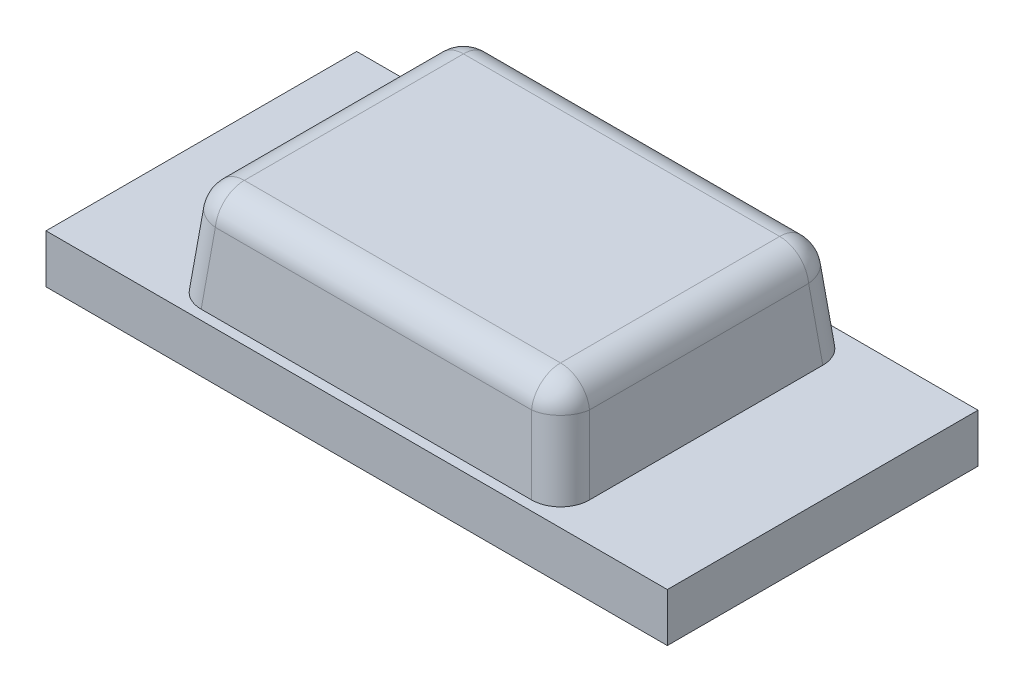
ISO-10303-21;
HEADER;
FILE_DESCRIPTION(('STEP AP214'),'2;1');
FILE_NAME('part.step','',(''),(''),'','','');
FILE_SCHEMA(('AUTOMOTIVE_DESIGN { 1 0 10303 214 1 1 1 1 }'));
ENDSEC;
DATA;
#1=APPLICATION_CONTEXT('core data for automotive mechanical design processes');
#2=APPLICATION_PROTOCOL_DEFINITION('international standard','automotive_design',2000,#1);
#3=PRODUCT_CONTEXT('',#1,'mechanical');
#4=PRODUCT('Part','Part','',(#3));
#5=PRODUCT_RELATED_PRODUCT_CATEGORY('part','',(#4));
#6=PRODUCT_DEFINITION_FORMATION('','',#4);
#7=PRODUCT_DEFINITION_CONTEXT('part definition',#1,'design');
#8=PRODUCT_DEFINITION('design','',#6,#7);
#9=PRODUCT_DEFINITION_SHAPE('','',#8);
#10=(LENGTH_UNIT() NAMED_UNIT(*) SI_UNIT(.MILLI.,.METRE.));
#11=(NAMED_UNIT(*) PLANE_ANGLE_UNIT() SI_UNIT($,.RADIAN.));
#12=(NAMED_UNIT(*) SI_UNIT($,.STERADIAN.) SOLID_ANGLE_UNIT());
#13=UNCERTAINTY_MEASURE_WITH_UNIT(LENGTH_MEASURE(1.E-05),#10,'distance_accuracy_value','');
#14=(GEOMETRIC_REPRESENTATION_CONTEXT(3) GLOBAL_UNCERTAINTY_ASSIGNED_CONTEXT((#13)) GLOBAL_UNIT_ASSIGNED_CONTEXT((#10,
#11,#12)) REPRESENTATION_CONTEXT('',''));
#15=CARTESIAN_POINT('',(0.,0.,0.));
#16=DIRECTION('',(0.,0.,1.));
#17=DIRECTION('',(1.,0.,0.));
#18=AXIS2_PLACEMENT_3D('',#15,#16,#17);
#19=CARTESIAN_POINT('',(0.,0.25,0.));
#20=DIRECTION('',(0.,-1.,0.));
#21=DIRECTION('',(0.,0.,-1.));
#22=AXIS2_PLACEMENT_3D('',#19,#20,#21);
#23=PLANE('',#22);
#24=DIRECTION('',(0.,0.,-1.));
#25=VECTOR('',#24,1.);
#26=CARTESIAN_POINT('',(1.6,0.25,0.799999999999998));
#27=LINE('',#26,#25);
#28=CARTESIAN_POINT('',(1.6,0.25,0.799999999999998));
#29=VERTEX_POINT('',#28);
#30=CARTESIAN_POINT('',(1.6,0.25,-0.800000000000002));
#31=VERTEX_POINT('',#30);
#32=EDGE_CURVE('E148',#29,#31,#27,.T.);
#33=ORIENTED_EDGE('',*,*,#32,.T.);
#34=DIRECTION('',(-1.,0.,0.));
#35=VECTOR('',#34,1.);
#36=CARTESIAN_POINT('',(-1.6,0.25,-0.800000000000002));
#37=LINE('',#36,#35);
#38=CARTESIAN_POINT('',(-1.6,0.25,-0.800000000000002));
#39=VERTEX_POINT('',#38);
#40=EDGE_CURVE('E137',#31,#39,#37,.T.);
#41=ORIENTED_EDGE('',*,*,#40,.T.);
#42=DIRECTION('',(0.,0.,1.));
#43=VECTOR('',#42,1.);
#44=CARTESIAN_POINT('',(-1.6,0.25,0.799999999999998));
#45=LINE('',#44,#43);
#46=CARTESIAN_POINT('',(-1.6,0.25,0.799999999999998));
#47=VERTEX_POINT('',#46);
#48=EDGE_CURVE('E147',#39,#47,#45,.T.);
#49=ORIENTED_EDGE('',*,*,#48,.T.);
#50=DIRECTION('',(1.,0.,0.));
#51=VECTOR('',#50,1.);
#52=CARTESIAN_POINT('',(-1.6,0.25,0.799999999999998));
#53=LINE('',#52,#51);
#54=EDGE_CURVE('E153',#47,#29,#53,.T.);
#55=ORIENTED_EDGE('',*,*,#54,.T.);
#56=EDGE_LOOP('',(#33,#41,#49,#55));
#57=FACE_BOUND('',#56,.T.);
#58=DIRECTION('',(0.,0.,-1.));
#59=VECTOR('',#58,1.);
#60=CARTESIAN_POINT('',(1.,0.25,0.750000000000002));
#61=LINE('',#60,#59);
#62=CARTESIAN_POINT('',(1.,0.25,0.600744266964108));
#63=VERTEX_POINT('',#62);
#64=CARTESIAN_POINT('',(1.,0.25,-0.600744266964107));
#65=VERTEX_POINT('',#64);
#66=EDGE_CURVE('E237',#63,#65,#61,.T.);
#67=ORIENTED_EDGE('',*,*,#66,.F.);
#68=CARTESIAN_POINT('',(0.849252021732466,0.25,0.599252021732468));
#69=DIRECTION('',(0.,-1.,0.));
#70=DIRECTION('',(0.707106781186548,0.,0.707106781186548));
#71=AXIS2_PLACEMENT_3D('',#68,#69,#70);
#72=ELLIPSE('',#71,0.151492263510379,0.15);
#73=CARTESIAN_POINT('',(0.850744266964105,0.25,0.750000000000002));
#74=VERTEX_POINT('',#73);
#75=EDGE_CURVE('E44',#63,#74,#72,.T.);
#76=ORIENTED_EDGE('',*,*,#75,.T.);
#77=DIRECTION('',(1.,0.,0.));
#78=VECTOR('',#77,1.);
#79=CARTESIAN_POINT('',(-1.,0.25,0.750000000000002));
#80=LINE('',#79,#78);
#81=CARTESIAN_POINT('',(-0.850744266964105,0.25,0.750000000000002));
#82=VERTEX_POINT('',#81);
#83=EDGE_CURVE('E248',#82,#74,#80,.T.);
#84=ORIENTED_EDGE('',*,*,#83,.F.);
#85=CARTESIAN_POINT('',(-0.849252021732466,0.25,0.599252021732468));
#86=DIRECTION('',(0.,-1.,0.));
#87=DIRECTION('',(-0.707106781186548,0.,0.707106781186548));
#88=AXIS2_PLACEMENT_3D('',#85,#86,#87);
#89=ELLIPSE('',#88,0.151492263510379,0.15);
#90=CARTESIAN_POINT('',(-1.,0.25,0.600744266964108));
#91=VERTEX_POINT('',#90);
#92=EDGE_CURVE('E11',#82,#91,#89,.T.);
#93=ORIENTED_EDGE('',*,*,#92,.T.);
#94=DIRECTION('',(0.,0.,1.));
#95=VECTOR('',#94,1.);
#96=CARTESIAN_POINT('',(-1.,0.25,0.750000000000002));
#97=LINE('',#96,#95);
#98=CARTESIAN_POINT('',(-1.,0.25,-0.600744266964107));
#99=VERTEX_POINT('',#98);
#100=EDGE_CURVE('E243',#99,#91,#97,.T.);
#101=ORIENTED_EDGE('',*,*,#100,.F.);
#102=CARTESIAN_POINT('',(-0.849252021732466,0.25,-0.599252021732468));
#103=DIRECTION('',(0.,-1.,0.));
#104=DIRECTION('',(-0.707106781186548,0.,-0.707106781186548));
#105=AXIS2_PLACEMENT_3D('',#102,#103,#104);
#106=ELLIPSE('',#105,0.151492263510379,0.15);
#107=CARTESIAN_POINT('',(-0.850744266964105,0.25,-0.750000000000002));
#108=VERTEX_POINT('',#107);
#109=EDGE_CURVE('E199',#99,#108,#106,.T.);
#110=ORIENTED_EDGE('',*,*,#109,.T.);
#111=DIRECTION('',(-1.,0.,0.));
#112=VECTOR('',#111,1.);
#113=CARTESIAN_POINT('',(-1.,0.25,-0.750000000000002));
#114=LINE('',#113,#112);
#115=CARTESIAN_POINT('',(0.850744266964105,0.25,-0.750000000000002));
#116=VERTEX_POINT('',#115);
#117=EDGE_CURVE('E239',#116,#108,#114,.T.);
#118=ORIENTED_EDGE('',*,*,#117,.F.);
#119=CARTESIAN_POINT('',(0.849252021732466,0.25,-0.599252021732468));
#120=DIRECTION('',(0.,-1.,0.));
#121=DIRECTION('',(0.707106781186548,0.,-0.707106781186548));
#122=AXIS2_PLACEMENT_3D('',#119,#120,#121);
#123=ELLIPSE('',#122,0.151492263510379,0.15);
#124=EDGE_CURVE('E201',#116,#65,#123,.T.);
#125=ORIENTED_EDGE('',*,*,#124,.T.);
#126=EDGE_LOOP('',(#67,#76,#84,#93,#101,#110,#118,#125));
#127=FACE_BOUND('',#126,.T.);
#128=ADVANCED_FACE('F35',(#57,#127),#23,.F.);
#129=CARTESIAN_POINT('',(1.6,0.25,0.799999999999998));
#130=DIRECTION('',(-1.,0.,0.));
#131=DIRECTION('',(0.,0.,1.));
#132=AXIS2_PLACEMENT_3D('',#129,#130,#131);
#133=PLANE('',#132);
#134=DIRECTION('',(0.,0.,-1.));
#135=VECTOR('',#134,1.);
#136=CARTESIAN_POINT('',(1.6,0.,0.799999999999998));
#137=LINE('',#136,#135);
#138=CARTESIAN_POINT('',(1.6,0.,0.799999999999998));
#139=VERTEX_POINT('',#138);
#140=CARTESIAN_POINT('',(1.6,0.,-0.800000000000002));
#141=VERTEX_POINT('',#140);
#142=EDGE_CURVE('E161',#139,#141,#137,.T.);
#143=ORIENTED_EDGE('',*,*,#142,.T.);
#144=DIRECTION('',(0.,-1.,0.));
#145=VECTOR('',#144,1.);
#146=CARTESIAN_POINT('',(1.6,0.25,-0.800000000000002));
#147=LINE('',#146,#145);
#148=EDGE_CURVE('E141',#31,#141,#147,.T.);
#149=ORIENTED_EDGE('',*,*,#148,.F.);
#150=ORIENTED_EDGE('',*,*,#32,.F.);
#151=DIRECTION('',(0.,-1.,0.));
#152=VECTOR('',#151,1.);
#153=CARTESIAN_POINT('',(1.6,0.25,0.799999999999998));
#154=LINE('',#153,#152);
#155=EDGE_CURVE('E253',#29,#139,#154,.T.);
#156=ORIENTED_EDGE('',*,*,#155,.T.);
#157=EDGE_LOOP('',(#143,#149,#150,#156));
#158=FACE_BOUND('',#157,.T.);
#159=ADVANCED_FACE('F159',(#158),#133,.F.);
#160=CARTESIAN_POINT('',(-1.6,0.25,-0.800000000000002));
#161=DIRECTION('',(0.,0.,1.));
#162=DIRECTION('',(1.,0.,0.));
#163=AXIS2_PLACEMENT_3D('',#160,#161,#162);
#164=PLANE('',#163);
#165=DIRECTION('',(-1.,0.,0.));
#166=VECTOR('',#165,1.);
#167=CARTESIAN_POINT('',(-1.6,0.,-0.800000000000002));
#168=LINE('',#167,#166);
#169=CARTESIAN_POINT('',(-1.6,0.,-0.800000000000002));
#170=VERTEX_POINT('',#169);
#171=EDGE_CURVE('E255',#141,#170,#168,.T.);
#172=ORIENTED_EDGE('',*,*,#171,.T.);
#173=DIRECTION('',(0.,-1.,0.));
#174=VECTOR('',#173,1.);
#175=CARTESIAN_POINT('',(-1.6,0.25,-0.800000000000002));
#176=LINE('',#175,#174);
#177=EDGE_CURVE('E144',#39,#170,#176,.T.);
#178=ORIENTED_EDGE('',*,*,#177,.F.);
#179=ORIENTED_EDGE('',*,*,#40,.F.);
#180=ORIENTED_EDGE('',*,*,#148,.T.);
#181=EDGE_LOOP('',(#172,#178,#179,#180));
#182=FACE_BOUND('',#181,.T.);
#183=ADVANCED_FACE('F139',(#182),#164,.F.);
#184=CARTESIAN_POINT('',(-1.6,0.25,0.799999999999998));
#185=DIRECTION('',(1.,0.,0.));
#186=DIRECTION('',(0.,0.,-1.));
#187=AXIS2_PLACEMENT_3D('',#184,#185,#186);
#188=PLANE('',#187);
#189=DIRECTION('',(0.,0.,1.));
#190=VECTOR('',#189,1.);
#191=CARTESIAN_POINT('',(-1.6,0.,0.799999999999998));
#192=LINE('',#191,#190);
#193=CARTESIAN_POINT('',(-1.6,0.,0.799999999999998));
#194=VERTEX_POINT('',#193);
#195=EDGE_CURVE('E257',#170,#194,#192,.T.);
#196=ORIENTED_EDGE('',*,*,#195,.T.);
#197=DIRECTION('',(0.,-1.,0.));
#198=VECTOR('',#197,1.);
#199=CARTESIAN_POINT('',(-1.6,0.25,0.799999999999998));
#200=LINE('',#199,#198);
#201=EDGE_CURVE('E166',#47,#194,#200,.T.);
#202=ORIENTED_EDGE('',*,*,#201,.F.);
#203=ORIENTED_EDGE('',*,*,#48,.F.);
#204=ORIENTED_EDGE('',*,*,#177,.T.);
#205=EDGE_LOOP('',(#196,#202,#203,#204));
#206=FACE_BOUND('',#205,.T.);
#207=ADVANCED_FACE('F269',(#206),#188,.F.);
#208=CARTESIAN_POINT('',(-1.6,0.25,0.799999999999998));
#209=DIRECTION('',(0.,0.,-1.));
#210=DIRECTION('',(-1.,0.,0.));
#211=AXIS2_PLACEMENT_3D('',#208,#209,#210);
#212=PLANE('',#211);
#213=DIRECTION('',(1.,0.,0.));
#214=VECTOR('',#213,1.);
#215=CARTESIAN_POINT('',(-1.6,0.,0.799999999999998));
#216=LINE('',#215,#214);
#217=EDGE_CURVE('E157',#194,#139,#216,.T.);
#218=ORIENTED_EDGE('',*,*,#217,.T.);
#219=ORIENTED_EDGE('',*,*,#155,.F.);
#220=ORIENTED_EDGE('',*,*,#54,.F.);
#221=ORIENTED_EDGE('',*,*,#201,.T.);
#222=EDGE_LOOP('',(#218,#219,#220,#221));
#223=FACE_BOUND('',#222,.T.);
#224=ADVANCED_FACE('F264',(#223),#212,.F.);
#225=CARTESIAN_POINT('',(0.,0.,0.));
#226=DIRECTION('',(0.,-1.,0.));
#227=DIRECTION('',(0.,0.,-1.));
#228=AXIS2_PLACEMENT_3D('',#225,#226,#227);
#229=PLANE('',#228);
#230=ORIENTED_EDGE('',*,*,#142,.F.);
#231=ORIENTED_EDGE('',*,*,#217,.F.);
#232=ORIENTED_EDGE('',*,*,#195,.F.);
#233=ORIENTED_EDGE('',*,*,#171,.F.);
#234=EDGE_LOOP('',(#230,#231,#232,#233));
#235=FACE_BOUND('',#234,.T.);
#236=ADVANCED_FACE('F268',(#235),#229,.T.);
#237=CARTESIAN_POINT('',(1.,0.25,0.750000000000002));
#238=DIRECTION('',(0.995038220239298,0.0994934181893926,0.));
#239=DIRECTION('',(-0.0994934181893926,0.995038220239299,0.));
#240=AXIS2_PLACEMENT_3D('',#237,#238,#239);
#241=PLANE('',#240);
#242=ORIENTED_EDGE('',*,*,#66,.T.);
#243=DIRECTION('',(-0.0990046045615373,0.990149572817778,0.0990046045615372));
#244=VECTOR('',#243,1.);
#245=CARTESIAN_POINT('',(0.986760123932997,0.382412605352665,-0.587504390897104));
#246=LINE('',#245,#244);
#247=CARTESIAN_POINT('',(0.96351141426808,0.614924012728409,-0.564255681232188));
#248=VERTEX_POINT('',#247);
#249=EDGE_CURVE('E52',#65,#248,#246,.T.);
#250=ORIENTED_EDGE('',*,*,#249,.T.);
#251=DIRECTION('',(0.,0.,-1.));
#252=VECTOR('',#251,1.);
#253=CARTESIAN_POINT('',(0.96351141426808,0.614924012728409,0.750000000000002));
#254=LINE('',#253,#252);
#255=CARTESIAN_POINT('',(0.96351141426808,0.614924012728409,0.564255681232188));
#256=VERTEX_POINT('',#255);
#257=EDGE_CURVE('E57',#248,#256,#254,.F.);
#258=ORIENTED_EDGE('',*,*,#257,.T.);
#259=DIRECTION('',(-0.0990046045615373,0.990149572817778,-0.0990046045615372));
#260=VECTOR('',#259,1.);
#261=CARTESIAN_POINT('',(1.00146299151958,0.235368554982266,0.602207258483684));
#262=LINE('',#261,#260);
#263=EDGE_CURVE('E195',#256,#63,#262,.F.);
#264=ORIENTED_EDGE('',*,*,#263,.T.);
#265=EDGE_LOOP('',(#242,#250,#258,#264));
#266=FACE_BOUND('',#265,.T.);
#267=ADVANCED_FACE('F289',(#266),#241,.T.);
#268=CARTESIAN_POINT('',(-1.,0.25,-0.750000000000002));
#269=DIRECTION('',(0.,0.0994934181893926,-0.995038220239298));
#270=DIRECTION('',(0.,0.995038220239299,0.0994934181893926));
#271=AXIS2_PLACEMENT_3D('',#268,#269,#270);
#272=PLANE('',#271);
#273=ORIENTED_EDGE('',*,*,#117,.T.);
#274=DIRECTION('',(0.0990046045615372,0.990149572817778,0.0990046045615372));
#275=VECTOR('',#274,1.);
#276=CARTESIAN_POINT('',(-0.852207258483682,0.235368554982266,-0.751462991519579));
#277=LINE('',#276,#275);
#278=CARTESIAN_POINT('',(-0.814255681232185,0.614924012728409,-0.713511414268082));
#279=VERTEX_POINT('',#278);
#280=EDGE_CURVE('E193',#108,#279,#277,.T.);
#281=ORIENTED_EDGE('',*,*,#280,.T.);
#282=DIRECTION('',(-1.,0.,0.));
#283=VECTOR('',#282,1.);
#284=CARTESIAN_POINT('',(-1.,0.614924012728409,-0.713511414268082));
#285=LINE('',#284,#283);
#286=CARTESIAN_POINT('',(0.814255681232186,0.614924012728409,-0.713511414268082));
#287=VERTEX_POINT('',#286);
#288=EDGE_CURVE('E191',#279,#287,#285,.F.);
#289=ORIENTED_EDGE('',*,*,#288,.T.);
#290=DIRECTION('',(-0.0990046045615372,0.990149572817778,0.0990046045615372));
#291=VECTOR('',#290,1.);
#292=CARTESIAN_POINT('',(0.832603435034909,0.431427288809464,-0.731859168070806));
#293=LINE('',#292,#291);
#294=EDGE_CURVE('E189',#287,#116,#293,.F.);
#295=ORIENTED_EDGE('',*,*,#294,.T.);
#296=EDGE_LOOP('',(#273,#281,#289,#295));
#297=FACE_BOUND('',#296,.T.);
#298=ADVANCED_FACE('F286',(#297),#272,.T.);
#299=CARTESIAN_POINT('',(-1.,0.25,0.750000000000002));
#300=DIRECTION('',(-0.995038220239298,0.0994934181893926,0.));
#301=DIRECTION('',(-0.0994934181893926,-0.995038220239299,0.));
#302=AXIS2_PLACEMENT_3D('',#299,#300,#301);
#303=PLANE('',#302);
#304=DIRECTION('',(0.,0.,1.));
#305=VECTOR('',#304,1.);
#306=CARTESIAN_POINT('',(-0.96351141426808,0.614924012728409,0.750000000000002));
#307=LINE('',#306,#305);
#308=CARTESIAN_POINT('',(-0.96351141426808,0.614924012728409,0.564255681232188));
#309=VERTEX_POINT('',#308);
#310=CARTESIAN_POINT('',(-0.96351141426808,0.614924012728409,-0.564255681232188));
#311=VERTEX_POINT('',#310);
#312=EDGE_CURVE('E185',#309,#311,#307,.F.);
#313=ORIENTED_EDGE('',*,*,#312,.T.);
#314=DIRECTION('',(0.0990046045615373,0.990149572817778,0.0990046045615372));
#315=VECTOR('',#314,1.);
#316=CARTESIAN_POINT('',(-0.986760123932997,0.382412605352665,-0.587504390897105));
#317=LINE('',#316,#315);
#318=EDGE_CURVE('E187',#311,#99,#317,.F.);
#319=ORIENTED_EDGE('',*,*,#318,.T.);
#320=ORIENTED_EDGE('',*,*,#100,.T.);
#321=DIRECTION('',(0.0990046045615373,0.990149572817778,-0.0990046045615372));
#322=VECTOR('',#321,1.);
#323=CARTESIAN_POINT('',(-1.00146299151958,0.235368554982266,0.602207258483684));
#324=LINE('',#323,#322);
#325=EDGE_CURVE('E183',#91,#309,#324,.T.);
#326=ORIENTED_EDGE('',*,*,#325,.T.);
#327=EDGE_LOOP('',(#313,#319,#320,#326));
#328=FACE_BOUND('',#327,.T.);
#329=ADVANCED_FACE('F297',(#328),#303,.T.);
#330=CARTESIAN_POINT('',(-1.,0.25,0.750000000000002));
#331=DIRECTION('',(0.,0.0994934181893926,0.995038220239298));
#332=DIRECTION('',(0.,-0.995038220239299,0.0994934181893926));
#333=AXIS2_PLACEMENT_3D('',#330,#331,#332);
#334=PLANE('',#333);
#335=ORIENTED_EDGE('',*,*,#83,.T.);
#336=DIRECTION('',(-0.0990046045615372,0.990149572817778,-0.0990046045615372));
#337=VECTOR('',#336,1.);
#338=CARTESIAN_POINT('',(0.832603435034909,0.431427288809464,0.731859168070806));
#339=LINE('',#338,#337);
#340=CARTESIAN_POINT('',(0.814255681232185,0.614924012728409,0.713511414268082));
#341=VERTEX_POINT('',#340);
#342=EDGE_CURVE('E181',#74,#341,#339,.T.);
#343=ORIENTED_EDGE('',*,*,#342,.T.);
#344=DIRECTION('',(1.,0.,0.));
#345=VECTOR('',#344,1.);
#346=CARTESIAN_POINT('',(-1.,0.614924012728409,0.713511414268082));
#347=LINE('',#346,#345);
#348=CARTESIAN_POINT('',(-0.814255681232185,0.614924012728409,0.713511414268082));
#349=VERTEX_POINT('',#348);
#350=EDGE_CURVE('E178',#341,#349,#347,.F.);
#351=ORIENTED_EDGE('',*,*,#350,.T.);
#352=DIRECTION('',(0.0990046045615372,0.990149572817778,-0.0990046045615372));
#353=VECTOR('',#352,1.);
#354=CARTESIAN_POINT('',(-0.852207258483682,0.235368554982266,0.751462991519579));
#355=LINE('',#354,#353);
#356=EDGE_CURVE('E176',#349,#82,#355,.F.);
#357=ORIENTED_EDGE('',*,*,#356,.T.);
#358=EDGE_LOOP('',(#335,#343,#351,#357));
#359=FACE_BOUND('',#358,.T.);
#360=ADVANCED_FACE('F302',(#359),#334,.T.);
#361=CARTESIAN_POINT('',(0.,0.75,0.));
#362=DIRECTION('',(0.,-1.,0.));
#363=DIRECTION('',(0.,0.,-1.));
#364=AXIS2_PLACEMENT_3D('',#361,#362,#363);
#365=PLANE('',#364);
#366=DIRECTION('',(0.,0.,-1.));
#367=VECTOR('',#366,1.);
#368=CARTESIAN_POINT('',(-0.814255681232185,0.75,0.));
#369=LINE('',#368,#367);
#370=CARTESIAN_POINT('',(-0.814255681232185,0.75,-0.564255681232187));
#371=VERTEX_POINT('',#370);
#372=CARTESIAN_POINT('',(-0.814255681232185,0.75,0.564255681232188));
#373=VERTEX_POINT('',#372);
#374=EDGE_CURVE('E171',#371,#373,#369,.F.);
#375=ORIENTED_EDGE('',*,*,#374,.T.);
#376=DIRECTION('',(-1.,0.,0.));
#377=VECTOR('',#376,1.);
#378=CARTESIAN_POINT('',(0.,0.75,0.564255681232188));
#379=LINE('',#378,#377);
#380=CARTESIAN_POINT('',(0.814255681232185,0.75,0.564255681232188));
#381=VERTEX_POINT('',#380);
#382=EDGE_CURVE('E173',#373,#381,#379,.F.);
#383=ORIENTED_EDGE('',*,*,#382,.T.);
#384=DIRECTION('',(0.,0.,1.));
#385=VECTOR('',#384,1.);
#386=CARTESIAN_POINT('',(0.814255681232185,0.75,0.));
#387=LINE('',#386,#385);
#388=CARTESIAN_POINT('',(0.814255681232185,0.75,-0.564255681232187));
#389=VERTEX_POINT('',#388);
#390=EDGE_CURVE('E162',#381,#389,#387,.F.);
#391=ORIENTED_EDGE('',*,*,#390,.T.);
#392=DIRECTION('',(1.,0.,0.));
#393=VECTOR('',#392,1.);
#394=CARTESIAN_POINT('',(0.,0.75,-0.564255681232187));
#395=LINE('',#394,#393);
#396=EDGE_CURVE('E164',#389,#371,#395,.F.);
#397=ORIENTED_EDGE('',*,*,#396,.T.);
#398=EDGE_LOOP('',(#375,#383,#391,#397));
#399=FACE_BOUND('',#398,.T.);
#400=ADVANCED_FACE('F301',(#399),#365,.F.);
#401=CARTESIAN_POINT('',(-0.837504390897102,0.367488592624256,-0.587504390897104));
#402=DIRECTION('',(-0.0990046045615372,-0.990149572817777,-0.0990046045615372));
#403=DIRECTION('',(0.,0.0994934181893926,-0.995038220239299));
#404=AXIS2_PLACEMENT_3D('',#401,#402,#403);
#405=CYLINDRICAL_SURFACE('',#404,0.15);
#406=ORIENTED_EDGE('',*,*,#109,.F.);
#407=ORIENTED_EDGE('',*,*,#318,.F.);
#408=CARTESIAN_POINT('',(-0.814255681232185,0.6,-0.564255681232187));
#409=DIRECTION('',(0.0990046045615369,0.990149572817778,0.099004604561537));
#410=DIRECTION('',(0.,-0.0994934181893923,0.995038220239299));
#411=AXIS2_PLACEMENT_3D('',#408,#409,#410);
#412=CIRCLE('',#411,0.15);
#413=EDGE_CURVE('E39',#279,#311,#412,.T.);
#414=ORIENTED_EDGE('',*,*,#413,.F.);
#415=ORIENTED_EDGE('',*,*,#280,.F.);
#416=EDGE_LOOP('',(#406,#407,#414,#415));
#417=FACE_BOUND('',#416,.T.);
#418=ADVANCED_FACE('F37',(#417),#405,.T.);
#419=CARTESIAN_POINT('',(0.,0.6,-0.564255681232187));
#420=DIRECTION('',(1.,0.,0.));
#421=DIRECTION('',(0.,0.,-1.));
#422=AXIS2_PLACEMENT_3D('',#419,#420,#421);
#423=CYLINDRICAL_SURFACE('',#422,0.15);
#424=CARTESIAN_POINT('',(0.814255681232186,0.6,-0.564255681232187));
#425=DIRECTION('',(1.,0.,0.));
#426=DIRECTION('',(0.,1.,0.));
#427=AXIS2_PLACEMENT_3D('',#424,#425,#426);
#428=CIRCLE('',#427,0.15);
#429=EDGE_CURVE('E229',#287,#389,#428,.T.);
#430=ORIENTED_EDGE('',*,*,#429,.F.);
#431=ORIENTED_EDGE('',*,*,#288,.F.);
#432=CARTESIAN_POINT('',(-0.814255681232185,0.6,-0.564255681232187));
#433=DIRECTION('',(-1.,0.,0.));
#434=DIRECTION('',(0.,0.,1.));
#435=AXIS2_PLACEMENT_3D('',#432,#433,#434);
#436=CIRCLE('',#435,0.15);
#437=EDGE_CURVE('E231',#371,#279,#436,.T.);
#438=ORIENTED_EDGE('',*,*,#437,.F.);
#439=ORIENTED_EDGE('',*,*,#396,.F.);
#440=EDGE_LOOP('',(#430,#431,#438,#439));
#441=FACE_BOUND('',#440,.T.);
#442=ADVANCED_FACE('F329',(#441),#423,.T.);
#443=CARTESIAN_POINT('',(0.832603435034909,0.416503276081055,-0.582603435034911));
#444=DIRECTION('',(0.0990046045615372,-0.990149572817777,-0.0990046045615372));
#445=DIRECTION('',(0.,0.0994934181893926,-0.995038220239299));
#446=AXIS2_PLACEMENT_3D('',#443,#444,#445);
#447=CYLINDRICAL_SURFACE('',#446,0.15);
#448=ORIENTED_EDGE('',*,*,#124,.F.);
#449=ORIENTED_EDGE('',*,*,#294,.F.);
#450=CARTESIAN_POINT('',(0.814255681232185,0.6,-0.564255681232188));
#451=DIRECTION('',(-0.099004604561537,0.990149572817778,0.0990046045615369));
#452=DIRECTION('',(-0.995038220239299,-0.0994934181893924,0.));
#453=AXIS2_PLACEMENT_3D('',#450,#451,#452);
#454=CIRCLE('',#453,0.15);
#455=EDGE_CURVE('E226',#248,#287,#454,.T.);
#456=ORIENTED_EDGE('',*,*,#455,.F.);
#457=ORIENTED_EDGE('',*,*,#249,.F.);
#458=EDGE_LOOP('',(#448,#449,#456,#457));
#459=FACE_BOUND('',#458,.T.);
#460=ADVANCED_FACE('F325',(#459),#447,.T.);
#461=CARTESIAN_POINT('',(-0.814255681232185,0.6,-0.564255681232187));
#462=DIRECTION('',(0.,0.,1.));
#463=DIRECTION('',(1.,0.,0.));
#464=AXIS2_PLACEMENT_3D('',#461,#462,#463);
#465=SPHERICAL_SURFACE('',#464,0.15);
#466=ORIENTED_EDGE('',*,*,#437,.T.);
#467=ORIENTED_EDGE('',*,*,#413,.T.);
#468=CARTESIAN_POINT('',(-0.814255681232185,0.6,-0.564255681232188));
#469=DIRECTION('',(0.,0.,-1.));
#470=DIRECTION('',(0.,1.,0.));
#471=AXIS2_PLACEMENT_3D('',#468,#469,#470);
#472=CIRCLE('',#471,0.15);
#473=EDGE_CURVE('E223',#371,#311,#472,.F.);
#474=ORIENTED_EDGE('',*,*,#473,.F.);
#475=EDGE_LOOP('',(#466,#467,#474));
#476=FACE_BOUND('',#475,.T.);
#477=ADVANCED_FACE('F359',(#476),#465,.T.);
#478=CARTESIAN_POINT('',(0.814255681232185,0.6,-0.564255681232187));
#479=DIRECTION('',(0.,0.,1.));
#480=DIRECTION('',(1.,0.,0.));
#481=AXIS2_PLACEMENT_3D('',#478,#479,#480);
#482=SPHERICAL_SURFACE('',#481,0.15);
#483=ORIENTED_EDGE('',*,*,#455,.T.);
#484=ORIENTED_EDGE('',*,*,#429,.T.);
#485=CARTESIAN_POINT('',(0.814255681232185,0.6,-0.564255681232187));
#486=DIRECTION('',(0.,0.,-1.));
#487=DIRECTION('',(-1.,0.,0.));
#488=AXIS2_PLACEMENT_3D('',#485,#486,#487);
#489=CIRCLE('',#488,0.15);
#490=EDGE_CURVE('E220',#248,#389,#489,.F.);
#491=ORIENTED_EDGE('',*,*,#490,.F.);
#492=EDGE_LOOP('',(#483,#484,#491));
#493=FACE_BOUND('',#492,.T.);
#494=ADVANCED_FACE('F331',(#493),#482,.T.);
#495=CARTESIAN_POINT('',(-0.852207258483682,0.220444542253857,0.602207258483684));
#496=DIRECTION('',(-0.0990046045615372,-0.990149572817777,0.0990046045615372));
#497=DIRECTION('',(0.,-0.0994934181893926,-0.995038220239299));
#498=AXIS2_PLACEMENT_3D('',#495,#496,#497);
#499=CYLINDRICAL_SURFACE('',#498,0.15);
#500=ORIENTED_EDGE('',*,*,#92,.F.);
#501=ORIENTED_EDGE('',*,*,#356,.F.);
#502=CARTESIAN_POINT('',(-0.814255681232185,0.6,0.564255681232188));
#503=DIRECTION('',(0.099004604561537,0.990149572817778,-0.099004604561537));
#504=DIRECTION('',(0.,0.0994934181893923,0.995038220239299));
#505=AXIS2_PLACEMENT_3D('',#502,#503,#504);
#506=CIRCLE('',#505,0.15);
#507=EDGE_CURVE('E217',#309,#349,#506,.T.);
#508=ORIENTED_EDGE('',*,*,#507,.F.);
#509=ORIENTED_EDGE('',*,*,#325,.F.);
#510=EDGE_LOOP('',(#500,#501,#508,#509));
#511=FACE_BOUND('',#510,.T.);
#512=ADVANCED_FACE('F353',(#511),#499,.T.);
#513=CARTESIAN_POINT('',(-0.814255681232185,0.6,0.));
#514=DIRECTION('',(0.,0.,-1.));
#515=DIRECTION('',(-1.,0.,0.));
#516=AXIS2_PLACEMENT_3D('',#513,#514,#515);
#517=CYLINDRICAL_SURFACE('',#516,0.15);
#518=ORIENTED_EDGE('',*,*,#473,.T.);
#519=ORIENTED_EDGE('',*,*,#312,.F.);
#520=CARTESIAN_POINT('',(-0.814255681232185,0.6,0.564255681232188));
#521=DIRECTION('',(0.,0.,1.));
#522=DIRECTION('',(1.,0.,0.));
#523=AXIS2_PLACEMENT_3D('',#520,#521,#522);
#524=CIRCLE('',#523,0.15);
#525=EDGE_CURVE('E214',#373,#309,#524,.T.);
#526=ORIENTED_EDGE('',*,*,#525,.F.);
#527=ORIENTED_EDGE('',*,*,#374,.F.);
#528=EDGE_LOOP('',(#518,#519,#526,#527));
#529=FACE_BOUND('',#528,.T.);
#530=ADVANCED_FACE('F357',(#529),#517,.T.);
#531=CARTESIAN_POINT('',(0.814255681232185,0.6,0.));
#532=DIRECTION('',(0.,0.,1.));
#533=DIRECTION('',(1.,0.,0.));
#534=AXIS2_PLACEMENT_3D('',#531,#532,#533);
#535=CYLINDRICAL_SURFACE('',#534,0.15);
#536=ORIENTED_EDGE('',*,*,#490,.T.);
#537=ORIENTED_EDGE('',*,*,#390,.F.);
#538=CARTESIAN_POINT('',(0.814255681232185,0.6,0.564255681232188));
#539=DIRECTION('',(0.,0.,1.));
#540=DIRECTION('',(0.,-1.,0.));
#541=AXIS2_PLACEMENT_3D('',#538,#539,#540);
#542=CIRCLE('',#541,0.15);
#543=EDGE_CURVE('E211',#256,#381,#542,.T.);
#544=ORIENTED_EDGE('',*,*,#543,.F.);
#545=ORIENTED_EDGE('',*,*,#257,.F.);
#546=EDGE_LOOP('',(#536,#537,#544,#545));
#547=FACE_BOUND('',#546,.T.);
#548=ADVANCED_FACE('F335',(#547),#535,.T.);
#549=CARTESIAN_POINT('',(0.852207258483682,0.220444542253857,0.602207258483684));
#550=DIRECTION('',(0.0990046045615372,-0.990149572817777,0.0990046045615372));
#551=DIRECTION('',(0.,-0.0994934181893926,-0.995038220239299));
#552=AXIS2_PLACEMENT_3D('',#549,#550,#551);
#553=CYLINDRICAL_SURFACE('',#552,0.15);
#554=ORIENTED_EDGE('',*,*,#75,.F.);
#555=ORIENTED_EDGE('',*,*,#263,.F.);
#556=CARTESIAN_POINT('',(0.814255681232185,0.6,0.564255681232188));
#557=DIRECTION('',(-0.0990046045615369,0.990149572817778,-0.099004604561537));
#558=DIRECTION('',(0.,0.0994934181893923,0.995038220239299));
#559=AXIS2_PLACEMENT_3D('',#556,#557,#558);
#560=CIRCLE('',#559,0.15);
#561=EDGE_CURVE('E208',#341,#256,#560,.T.);
#562=ORIENTED_EDGE('',*,*,#561,.F.);
#563=ORIENTED_EDGE('',*,*,#342,.F.);
#564=EDGE_LOOP('',(#554,#555,#562,#563));
#565=FACE_BOUND('',#564,.T.);
#566=ADVANCED_FACE('F344',(#565),#553,.T.);
#567=CARTESIAN_POINT('',(-0.814255681232185,0.6,0.564255681232188));
#568=DIRECTION('',(0.,0.,1.));
#569=DIRECTION('',(1.,0.,0.));
#570=AXIS2_PLACEMENT_3D('',#567,#568,#569);
#571=SPHERICAL_SURFACE('',#570,0.15);
#572=ORIENTED_EDGE('',*,*,#525,.T.);
#573=ORIENTED_EDGE('',*,*,#507,.T.);
#574=CARTESIAN_POINT('',(-0.814255681232185,0.6,0.564255681232188));
#575=DIRECTION('',(-1.,0.,0.));
#576=DIRECTION('',(0.,0.,1.));
#577=AXIS2_PLACEMENT_3D('',#574,#575,#576);
#578=CIRCLE('',#577,0.15);
#579=EDGE_CURVE('E206',#373,#349,#578,.F.);
#580=ORIENTED_EDGE('',*,*,#579,.F.);
#581=EDGE_LOOP('',(#572,#573,#580));
#582=FACE_BOUND('',#581,.T.);
#583=ADVANCED_FACE('F355',(#582),#571,.T.);
#584=CARTESIAN_POINT('',(0.814255681232185,0.6,0.564255681232188));
#585=DIRECTION('',(0.,0.,1.));
#586=DIRECTION('',(1.,0.,0.));
#587=AXIS2_PLACEMENT_3D('',#584,#585,#586);
#588=SPHERICAL_SURFACE('',#587,0.15);
#589=ORIENTED_EDGE('',*,*,#561,.T.);
#590=ORIENTED_EDGE('',*,*,#543,.T.);
#591=CARTESIAN_POINT('',(0.814255681232185,0.6,0.564255681232188));
#592=DIRECTION('',(1.,0.,0.));
#593=DIRECTION('',(0.,0.,-1.));
#594=AXIS2_PLACEMENT_3D('',#591,#592,#593);
#595=CIRCLE('',#594,0.15);
#596=EDGE_CURVE('E204',#341,#381,#595,.F.);
#597=ORIENTED_EDGE('',*,*,#596,.F.);
#598=EDGE_LOOP('',(#589,#590,#597));
#599=FACE_BOUND('',#598,.T.);
#600=ADVANCED_FACE('F339',(#599),#588,.T.);
#601=CARTESIAN_POINT('',(0.,0.6,0.564255681232188));
#602=DIRECTION('',(-1.,0.,0.));
#603=DIRECTION('',(0.,0.,1.));
#604=AXIS2_PLACEMENT_3D('',#601,#602,#603);
#605=CYLINDRICAL_SURFACE('',#604,0.15);
#606=ORIENTED_EDGE('',*,*,#579,.T.);
#607=ORIENTED_EDGE('',*,*,#350,.F.);
#608=ORIENTED_EDGE('',*,*,#596,.T.);
#609=ORIENTED_EDGE('',*,*,#382,.F.);
#610=EDGE_LOOP('',(#606,#607,#608,#609));
#611=FACE_BOUND('',#610,.T.);
#612=ADVANCED_FACE('F346',(#611),#605,.T.);
#613=CLOSED_SHELL('',(#128,#159,#183,#207,#224,#236,#267,#298,#329,#360,#400,#418,#442,#460,
#477,#494,#512,#530,#548,#566,#583,#600,#612));
#614=MANIFOLD_SOLID_BREP('B2',#613);
#615=ADVANCED_BREP_SHAPE_REPRESENTATION('',(#18,#614),#14);
#616=SHAPE_DEFINITION_REPRESENTATION(#9,#615);
ENDSEC;
END-ISO-10303-21;
